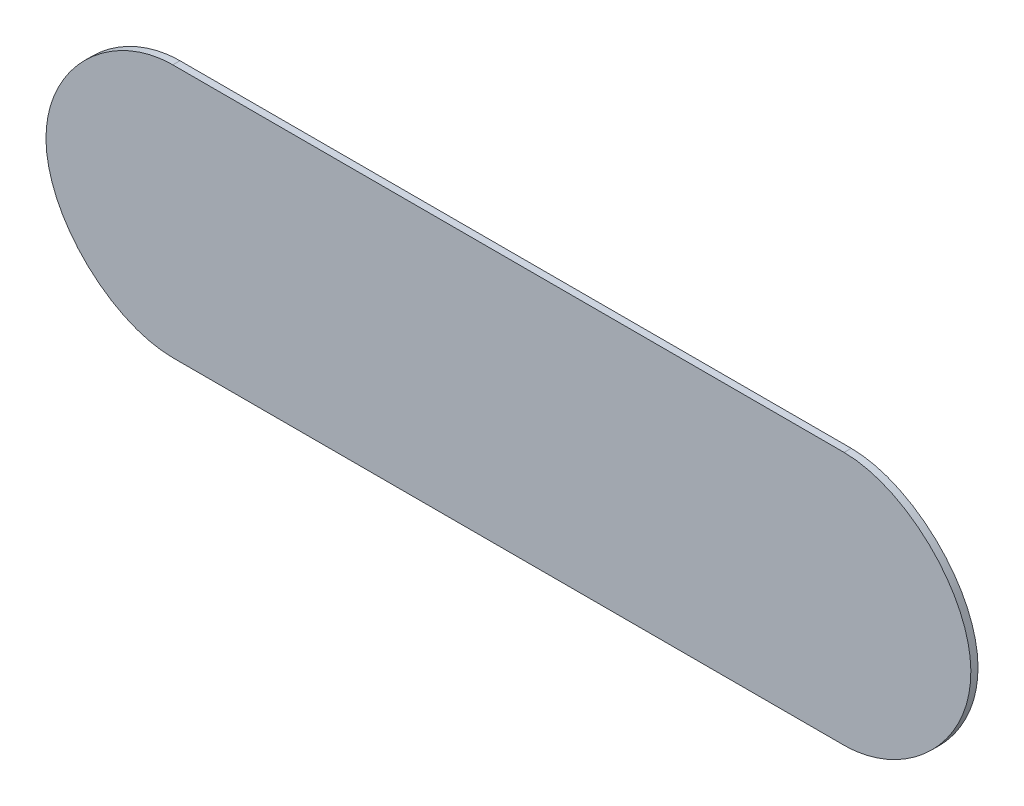
ISO-10303-21;
HEADER;
FILE_DESCRIPTION(('STEP AP214'),'2;1');
FILE_NAME('part.step','',(''),(''),'','','');
FILE_SCHEMA(('AUTOMOTIVE_DESIGN { 1 0 10303 214 1 1 1 1 }'));
ENDSEC;
DATA;
#1=APPLICATION_CONTEXT('core data for automotive mechanical design processes');
#2=APPLICATION_PROTOCOL_DEFINITION('international standard','automotive_design',2000,#1);
#3=PRODUCT_CONTEXT('',#1,'mechanical');
#4=PRODUCT('Part','Part','',(#3));
#5=PRODUCT_RELATED_PRODUCT_CATEGORY('part','',(#4));
#6=PRODUCT_DEFINITION_FORMATION('','',#4);
#7=PRODUCT_DEFINITION_CONTEXT('part definition',#1,'design');
#8=PRODUCT_DEFINITION('design','',#6,#7);
#9=PRODUCT_DEFINITION_SHAPE('','',#8);
#10=(LENGTH_UNIT() NAMED_UNIT(*) SI_UNIT(.MILLI.,.METRE.));
#11=(NAMED_UNIT(*) PLANE_ANGLE_UNIT() SI_UNIT($,.RADIAN.));
#12=(NAMED_UNIT(*) SI_UNIT($,.STERADIAN.) SOLID_ANGLE_UNIT());
#13=UNCERTAINTY_MEASURE_WITH_UNIT(LENGTH_MEASURE(1.E-05),#10,'distance_accuracy_value','');
#14=(GEOMETRIC_REPRESENTATION_CONTEXT(3) GLOBAL_UNCERTAINTY_ASSIGNED_CONTEXT((#13)) GLOBAL_UNIT_ASSIGNED_CONTEXT((#10,
#11,#12)) REPRESENTATION_CONTEXT('',''));
#15=CARTESIAN_POINT('',(0.,0.,0.));
#16=DIRECTION('',(0.,0.,1.));
#17=DIRECTION('',(1.,0.,0.));
#18=AXIS2_PLACEMENT_3D('',#15,#16,#17);
#19=CARTESIAN_POINT('',(-18.2385225793299,83.2267730791614,78.0152897660924));
#20=DIRECTION('',(-4.60605988968506E-11,1.,0.));
#21=DIRECTION('',(-1.,-4.60605988968506E-11,0.));
#22=AXIS2_PLACEMENT_3D('',#19,#20,#21);
#23=PLANE('',#22);
#24=CARTESIAN_POINT('',(-18.2385225793299,83.2267730791614,77.1628374674978));
#25=CARTESIAN_POINT('',(8.42811647712011,83.2267730803897,77.1628374674978));
#26=CARTESIAN_POINT('',(35.0947555335701,83.226773081618,77.1628374674978));
#27=CARTESIAN_POINT('',(61.7613945900201,83.2267730828463,77.1628374674978));
#28=B_SPLINE_CURVE_WITH_KNOTS('',3,(#24,#25,#26,#27),.UNSPECIFIED.,.F.,.F.,(4,4),(0.,1.),.UNSPECIFIED.);
#29=CARTESIAN_POINT('',(-18.2386972334346,83.2267774832469,77.1628374674978));
#30=VERTEX_POINT('',#29);
#31=CARTESIAN_POINT('',(61.7615673621936,83.2267743288953,77.1628374674978));
#32=VERTEX_POINT('',#31);
#33=EDGE_CURVE('E104',#30,#32,#28,.T.);
#34=ORIENTED_EDGE('',*,*,#33,.F.);
#35=CARTESIAN_POINT('',(-18.2386972033674,83.2267774833319,78.0152897660924));
#36=DIRECTION('',(0.,0.,-1.));
#37=VECTOR('',#36,1.);
#38=LINE('',#35,#37);
#39=CARTESIAN_POINT('',(-18.2386972334346,83.2267774832469,78.0152897660924));
#40=VERTEX_POINT('',#39);
#41=EDGE_CURVE('E35',#40,#30,#38,.T.);
#42=ORIENTED_EDGE('',*,*,#41,.F.);
#43=CARTESIAN_POINT('',(-18.2385225793299,83.2267730791614,78.0152897660924));
#44=CARTESIAN_POINT('',(8.42811647712011,83.2267730803897,78.0152897660924));
#45=CARTESIAN_POINT('',(35.0947555335701,83.226773081618,78.0152897660924));
#46=CARTESIAN_POINT('',(61.7613945900201,83.2267730828463,78.0152897660924));
#47=B_SPLINE_CURVE_WITH_KNOTS('',3,(#43,#44,#45,#46),.UNSPECIFIED.,.F.,.F.,(4,4),(0.,1.),.UNSPECIFIED.);
#48=CARTESIAN_POINT('',(61.7615673621936,83.2267743288953,78.0152897660924));
#49=VERTEX_POINT('',#48);
#50=EDGE_CURVE('E82',#40,#49,#47,.T.);
#51=ORIENTED_EDGE('',*,*,#50,.T.);
#52=CARTESIAN_POINT('',(61.761567335667,83.2267743289372,77.1628374674978));
#53=DIRECTION('',(0.,0.,1.));
#54=VECTOR('',#53,1.);
#55=LINE('',#52,#54);
#56=EDGE_CURVE('E10',#49,#32,#55,.F.);
#57=ORIENTED_EDGE('',*,*,#56,.T.);
#58=EDGE_LOOP('',(#34,#42,#51,#57));
#59=FACE_BOUND('',#58,.T.);
#60=ADVANCED_FACE('F16',(#59),#23,.T.);
#61=CARTESIAN_POINT('',(61.7582354106845,83.2267790995175,78.0152897660924));
#62=CARTESIAN_POINT('',(69.0879619199239,83.2173731905281,78.0152897660885));
#63=CARTESIAN_POINT('',(76.8749823021789,76.0223954065077,78.0152897660924));
#64=CARTESIAN_POINT('',(76.8747755319446,60.1974114286048,78.0152897660924));
#65=CARTESIAN_POINT('',(69.0863408000496,53.0122412704765,78.0152897660924));
#66=CARTESIAN_POINT('',(61.7552601690483,52.9956503332076,78.0152897660924));
#67=B_SPLINE_CURVE_WITH_KNOTS('',3,(#61,#62,#63,#64,#65,#66),.UNSPECIFIED.,.F.,.F.,(4,2,4),(0.,
0.500115966796875,1.00033571884036),.UNSPECIFIED.);
#68=DIRECTION('',(0.,0.,-1.));
#69=VECTOR('',#68,1.);
#70=SURFACE_OF_LINEAR_EXTRUSION('',#67,#69);
#71=CARTESIAN_POINT('',(61.7582354106845,83.2267790995175,77.1628374674978));
#72=CARTESIAN_POINT('',(69.0879619199239,83.2173731905281,77.162837467494));
#73=CARTESIAN_POINT('',(76.8749823021789,76.0223954065077,77.1628374674978));
#74=CARTESIAN_POINT('',(76.8747755319446,60.1974114286048,77.1628374674979));
#75=CARTESIAN_POINT('',(69.0863408000496,53.0122412704765,77.1628374674978));
#76=CARTESIAN_POINT('',(61.7552601690483,52.9956503332076,77.1628374674978));
#77=B_SPLINE_CURVE_WITH_KNOTS('',3,(#71,#72,#73,#74,#75,#76),.UNSPECIFIED.,.F.,.F.,(4,2,4),(0.,
0.500115966796875,1.00033571884036),.UNSPECIFIED.);
#78=CARTESIAN_POINT('',(61.7616138203378,52.9956665064771,77.1628374674978));
#79=VERTEX_POINT('',#78);
#80=EDGE_CURVE('E170',#32,#79,#77,.T.);
#81=ORIENTED_EDGE('',*,*,#80,.F.);
#82=ORIENTED_EDGE('',*,*,#56,.F.);
#83=CARTESIAN_POINT('',(61.7616138203378,52.9956665064771,78.0152897660924));
#84=VERTEX_POINT('',#83);
#85=EDGE_CURVE('E78',#49,#84,#67,.T.);
#86=ORIENTED_EDGE('',*,*,#85,.T.);
#87=CARTESIAN_POINT('',(61.7616137900612,52.9956665063915,78.0152897660924));
#88=DIRECTION('',(0.,0.,-1.));
#89=VECTOR('',#88,1.);
#90=LINE('',#87,#89);
#91=EDGE_CURVE('E27',#84,#79,#90,.T.);
#92=ORIENTED_EDGE('',*,*,#91,.T.);
#93=EDGE_LOOP('',(#81,#82,#86,#92));
#94=FACE_BOUND('',#93,.T.);
#95=ADVANCED_FACE('F79',(#94),#70,.T.);
#96=CARTESIAN_POINT('',(61.7614376277819,52.9956709094879,78.0152897660924));
#97=DIRECTION('',(-1.99614656177434E-11,-1.,0.));
#98=DIRECTION('',(1.,-1.99614656177434E-11,0.));
#99=AXIS2_PLACEMENT_3D('',#96,#97,#98);
#100=PLANE('',#99);
#101=CARTESIAN_POINT('',(61.7614376277819,52.9956709094879,77.1628374674978));
#102=CARTESIAN_POINT('',(35.0947744073262,52.9956709100202,77.1628374674978));
#103=CARTESIAN_POINT('',(8.4281111868705,52.9956709105525,77.1628374674978));
#104=CARTESIAN_POINT('',(-18.2385520335852,52.9956709110848,77.1628374674978));
#105=B_SPLINE_CURVE_WITH_KNOTS('',3,(#101,#102,#103,#104),.UNSPECIFIED.,.F.,.F.,(4,4),(0.,1.),.UNSPECIFIED.);
#106=CARTESIAN_POINT('',(-18.2387290276308,52.9956699379387,77.1628374674978));
#107=VERTEX_POINT('',#106);
#108=EDGE_CURVE('E73',#79,#107,#105,.T.);
#109=ORIENTED_EDGE('',*,*,#108,.F.);
#110=ORIENTED_EDGE('',*,*,#91,.F.);
#111=CARTESIAN_POINT('',(61.7614376277819,52.9956709094879,78.0152897660924));
#112=CARTESIAN_POINT('',(35.0947744073262,52.9956709100202,78.0152897660924));
#113=CARTESIAN_POINT('',(8.4281111868705,52.9956709105525,78.0152897660924));
#114=CARTESIAN_POINT('',(-18.2385520335852,52.9956709110848,78.0152897660924));
#115=B_SPLINE_CURVE_WITH_KNOTS('',3,(#111,#112,#113,#114),.UNSPECIFIED.,.F.,.F.,(4,4),(0.,1.),.UNSPECIFIED.);
#116=CARTESIAN_POINT('',(-18.2387290276308,52.9956699379387,78.0152897660924));
#117=VERTEX_POINT('',#116);
#118=EDGE_CURVE('E70',#84,#117,#115,.T.);
#119=ORIENTED_EDGE('',*,*,#118,.T.);
#120=CARTESIAN_POINT('',(-18.2387289974489,52.9956699378958,77.1628374674978));
#121=DIRECTION('',(0.,0.,1.));
#122=VECTOR('',#121,1.);
#123=LINE('',#120,#122);
#124=EDGE_CURVE('E52',#117,#107,#123,.F.);
#125=ORIENTED_EDGE('',*,*,#124,.T.);
#126=EDGE_LOOP('',(#109,#110,#119,#125));
#127=FACE_BOUND('',#126,.T.);
#128=ADVANCED_FACE('F68',(#127),#100,.T.);
#129=CARTESIAN_POINT('',(-18.2357312436474,52.9956660799783,78.0152897660924));
#130=CARTESIAN_POINT('',(-25.5652961126907,53.0041189602096,78.0152897660835));
#131=CARTESIAN_POINT('',(-33.3522186971457,60.2004114740095,78.0152897660927));
#132=CARTESIAN_POINT('',(-33.3517473762338,76.0249664530785,78.0152897660921));
#133=CARTESIAN_POINT('',(-25.5634216468391,83.2102107567064,78.0152897660924));
#134=CARTESIAN_POINT('',(-18.232344018269,83.2267936483389,78.0152897660924));
#135=B_SPLINE_CURVE_WITH_KNOTS('',3,(#129,#130,#131,#132,#133,#134),.UNSPECIFIED.,.F.,.F.,(4,2,
4),(0.,0.500103759765625,1.0003235091269),.UNSPECIFIED.);
#136=DIRECTION('',(0.,0.,-1.));
#137=VECTOR('',#136,1.);
#138=SURFACE_OF_LINEAR_EXTRUSION('',#135,#137);
#139=CARTESIAN_POINT('',(-18.2357312436474,52.9956660799783,77.1628374674979));
#140=CARTESIAN_POINT('',(-25.5652961126907,53.0041189602096,77.162837467489));
#141=CARTESIAN_POINT('',(-33.3522186971457,60.2004114740095,77.1628374674982));
#142=CARTESIAN_POINT('',(-33.3517473762338,76.0249664530785,77.1628374674975));
#143=CARTESIAN_POINT('',(-25.5634216468391,83.2102107567064,77.1628374674978));
#144=CARTESIAN_POINT('',(-18.232344018269,83.2267936483389,77.1628374674978));
#145=B_SPLINE_CURVE_WITH_KNOTS('',3,(#139,#140,#141,#142,#143,#144),.UNSPECIFIED.,.F.,.F.,(4,2,
4),(0.,0.500103759765625,1.0003235091269),.UNSPECIFIED.);
#146=EDGE_CURVE('E157',#107,#30,#145,.T.);
#147=ORIENTED_EDGE('',*,*,#146,.F.);
#148=ORIENTED_EDGE('',*,*,#124,.F.);
#149=EDGE_CURVE('E85',#117,#40,#135,.T.);
#150=ORIENTED_EDGE('',*,*,#149,.T.);
#151=ORIENTED_EDGE('',*,*,#41,.T.);
#152=EDGE_LOOP('',(#147,#148,#150,#151));
#153=FACE_BOUND('',#152,.T.);
#154=ADVANCED_FACE('F111',(#153),#138,.T.);
#155=CARTESIAN_POINT('',(21.7183424939833,54.1112219928033,78.0152897660924));
#156=DIRECTION('',(0.,0.,-1.));
#157=DIRECTION('',(0.,1.,0.));
#158=AXIS2_PLACEMENT_3D('',#155,#156,#157);
#159=PLANE('',#158);
#160=ORIENTED_EDGE('',*,*,#50,.F.);
#161=ORIENTED_EDGE('',*,*,#149,.F.);
#162=ORIENTED_EDGE('',*,*,#118,.F.);
#163=ORIENTED_EDGE('',*,*,#85,.F.);
#164=EDGE_LOOP('',(#160,#161,#162,#163));
#165=FACE_BOUND('',#164,.T.);
#166=ADVANCED_FACE('F84',(#165),#159,.F.);
#167=CARTESIAN_POINT('',(21.7183424939833,54.1112219928033,77.1628374674978));
#168=DIRECTION('',(0.,0.,-1.));
#169=DIRECTION('',(0.,1.,0.));
#170=AXIS2_PLACEMENT_3D('',#167,#168,#169);
#171=PLANE('',#170);
#172=ORIENTED_EDGE('',*,*,#33,.T.);
#173=ORIENTED_EDGE('',*,*,#80,.T.);
#174=ORIENTED_EDGE('',*,*,#108,.T.);
#175=ORIENTED_EDGE('',*,*,#146,.T.);
#176=EDGE_LOOP('',(#172,#173,#174,#175));
#177=FACE_BOUND('',#176,.T.);
#178=ADVANCED_FACE('F116',(#177),#171,.T.);
#179=CLOSED_SHELL('',(#60,#95,#128,#154,#166,#178));
#180=MANIFOLD_SOLID_BREP('B1',#179);
#181=ADVANCED_BREP_SHAPE_REPRESENTATION('',(#18,#180),#14);
#182=SHAPE_DEFINITION_REPRESENTATION(#9,#181);
ENDSEC;
END-ISO-10303-21;
